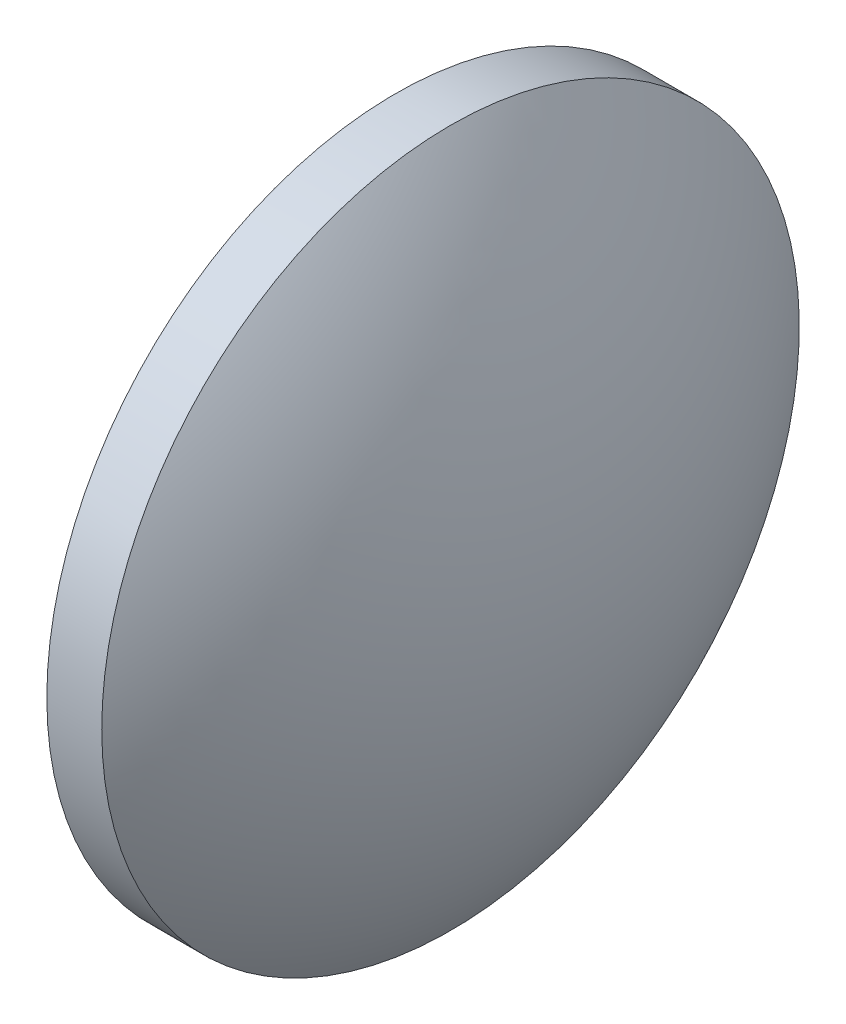
ISO-10303-21;
HEADER;
FILE_DESCRIPTION(('STEP AP214'),'2;1');
FILE_NAME('part.step','',(''),(''),'','','');
FILE_SCHEMA(('AUTOMOTIVE_DESIGN { 1 0 10303 214 1 1 1 1 }'));
ENDSEC;
DATA;
#1=APPLICATION_CONTEXT('core data for automotive mechanical design processes');
#2=APPLICATION_PROTOCOL_DEFINITION('international standard','automotive_design',2000,#1);
#3=PRODUCT_CONTEXT('',#1,'mechanical');
#4=PRODUCT('Part','Part','',(#3));
#5=PRODUCT_RELATED_PRODUCT_CATEGORY('part','',(#4));
#6=PRODUCT_DEFINITION_FORMATION('','',#4);
#7=PRODUCT_DEFINITION_CONTEXT('part definition',#1,'design');
#8=PRODUCT_DEFINITION('design','',#6,#7);
#9=PRODUCT_DEFINITION_SHAPE('','',#8);
#10=(LENGTH_UNIT() NAMED_UNIT(*) SI_UNIT(.MILLI.,.METRE.));
#11=(NAMED_UNIT(*) PLANE_ANGLE_UNIT() SI_UNIT($,.RADIAN.));
#12=(NAMED_UNIT(*) SI_UNIT($,.STERADIAN.) SOLID_ANGLE_UNIT());
#13=UNCERTAINTY_MEASURE_WITH_UNIT(LENGTH_MEASURE(1.E-05),#10,'distance_accuracy_value','');
#14=(GEOMETRIC_REPRESENTATION_CONTEXT(3) GLOBAL_UNCERTAINTY_ASSIGNED_CONTEXT((#13)) GLOBAL_UNIT_ASSIGNED_CONTEXT((#10,
#11,#12)) REPRESENTATION_CONTEXT('',''));
#15=CARTESIAN_POINT('',(0.,0.,0.));
#16=DIRECTION('',(0.,0.,1.));
#17=DIRECTION('',(1.,0.,0.));
#18=AXIS2_PLACEMENT_3D('',#15,#16,#17);
#19=CARTESIAN_POINT('',(663.790833240061,68.0361646028624,0.));
#20=DIRECTION('',(-1.,0.,0.));
#21=DIRECTION('',(0.,1.,0.));
#22=AXIS2_PLACEMENT_3D('',#19,#20,#21);
#23=SPHERICAL_SURFACE('',#22,21.719512195122);
#24=CARTESIAN_POINT('',(681.410345435183,68.0361646028624,0.));
#25=DIRECTION('',(-1.,0.,0.));
#26=DIRECTION('',(0.,0.,1.));
#27=AXIS2_PLACEMENT_3D('',#24,#25,#26);
#28=CIRCLE('',#27,12.7);
#29=CARTESIAN_POINT('',(681.410345435183,68.0361646028624,12.7));
#30=VERTEX_POINT('',#29);
#31=EDGE_CURVE('E10',#30,#30,#28,.T.);
#32=ORIENTED_EDGE('',*,*,#31,.F.);
#33=EDGE_LOOP('',(#32));
#34=FACE_BOUND('',#33,.T.);
#35=ADVANCED_FACE('F35',(#34),#23,.T.);
#36=CARTESIAN_POINT('',(673.672127399507,68.0361646028624,0.));
#37=DIRECTION('',(-1.,0.,0.));
#38=DIRECTION('',(0.,0.,1.));
#39=AXIS2_PLACEMENT_3D('',#36,#37,#38);
#40=CYLINDRICAL_SURFACE('',#39,12.7);
#41=CARTESIAN_POINT('',(679.410345435183,68.0361646028624,0.));
#42=DIRECTION('',(-1.,0.,0.));
#43=DIRECTION('',(0.,0.,1.));
#44=AXIS2_PLACEMENT_3D('',#41,#42,#43);
#45=CIRCLE('',#44,12.7);
#46=CARTESIAN_POINT('',(679.410345435183,68.0361646028624,12.7));
#47=VERTEX_POINT('',#46);
#48=EDGE_CURVE('E41',#47,#47,#45,.T.);
#49=ORIENTED_EDGE('',*,*,#48,.F.);
#50=EDGE_LOOP('',(#49));
#51=FACE_BOUND('',#50,.T.);
#52=ORIENTED_EDGE('',*,*,#31,.T.);
#53=EDGE_LOOP('',(#52));
#54=FACE_BOUND('',#53,.T.);
#55=ADVANCED_FACE('F49',(#51,#54),#40,.T.);
#56=CARTESIAN_POINT('',(679.410345435183,68.0361646028624,0.));
#57=DIRECTION('',(1.,0.,0.));
#58=DIRECTION('',(0.,0.,-1.));
#59=AXIS2_PLACEMENT_3D('',#56,#57,#58);
#60=PLANE('',#59);
#61=ORIENTED_EDGE('',*,*,#48,.T.);
#62=EDGE_LOOP('',(#61));
#63=FACE_BOUND('',#62,.T.);
#64=ADVANCED_FACE('F47',(#63),#60,.F.);
#65=CLOSED_SHELL('',(#35,#55,#64));
#66=MANIFOLD_SOLID_BREP('B2',#65);
#67=ADVANCED_BREP_SHAPE_REPRESENTATION('',(#18,#66),#14);
#68=SHAPE_DEFINITION_REPRESENTATION(#9,#67);
ENDSEC;
END-ISO-10303-21;
